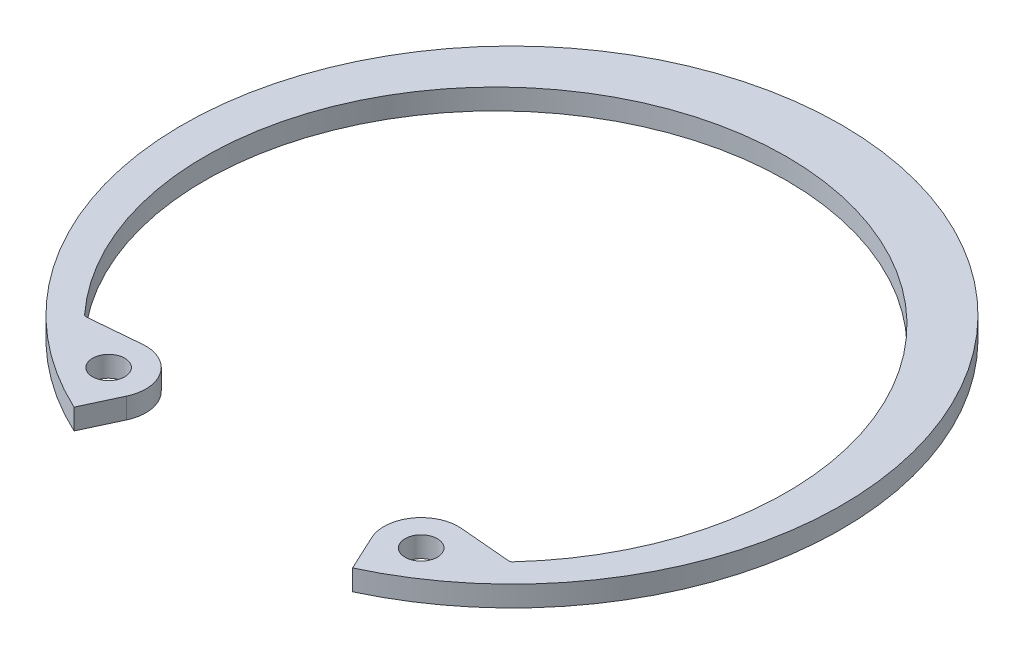
ISO-10303-21;
HEADER;
FILE_DESCRIPTION(('STEP AP214'),'2;1');
FILE_NAME('part.step','',(''),(''),'','','');
FILE_SCHEMA(('AUTOMOTIVE_DESIGN { 1 0 10303 214 1 1 1 1 }'));
ENDSEC;
DATA;
#1=APPLICATION_CONTEXT('core data for automotive mechanical design processes');
#2=APPLICATION_PROTOCOL_DEFINITION('international standard','automotive_design',2000,#1);
#3=PRODUCT_CONTEXT('',#1,'mechanical');
#4=PRODUCT('Part','Part','',(#3));
#5=PRODUCT_RELATED_PRODUCT_CATEGORY('part','',(#4));
#6=PRODUCT_DEFINITION_FORMATION('','',#4);
#7=PRODUCT_DEFINITION_CONTEXT('part definition',#1,'design');
#8=PRODUCT_DEFINITION('design','',#6,#7);
#9=PRODUCT_DEFINITION_SHAPE('','',#8);
#10=(LENGTH_UNIT() NAMED_UNIT(*) SI_UNIT(.MILLI.,.METRE.));
#11=(NAMED_UNIT(*) PLANE_ANGLE_UNIT() SI_UNIT($,.RADIAN.));
#12=(NAMED_UNIT(*) SI_UNIT($,.STERADIAN.) SOLID_ANGLE_UNIT());
#13=UNCERTAINTY_MEASURE_WITH_UNIT(LENGTH_MEASURE(1.E-05),#10,'distance_accuracy_value','');
#14=(GEOMETRIC_REPRESENTATION_CONTEXT(3) GLOBAL_UNCERTAINTY_ASSIGNED_CONTEXT((#13)) GLOBAL_UNIT_ASSIGNED_CONTEXT((#10,
#11,#12)) REPRESENTATION_CONTEXT('',''));
#15=CARTESIAN_POINT('',(0.,0.,0.));
#16=DIRECTION('',(0.,0.,1.));
#17=DIRECTION('',(1.,0.,0.));
#18=AXIS2_PLACEMENT_3D('',#15,#16,#17);
#19=CARTESIAN_POINT('',(9.59937081174738,-1.27,15.1767803192434));
#20=DIRECTION('',(0.,1.,0.));
#21=DIRECTION('',(0.,0.,1.));
#22=AXIS2_PLACEMENT_3D('',#19,#20,#21);
#23=CYLINDRICAL_SURFACE('',#22,2.286);
#24=CARTESIAN_POINT('',(9.59937081174738,0.,15.1767803192434));
#25=DIRECTION('',(0.,1.,0.));
#26=DIRECTION('',(0.,0.,-1.));
#27=AXIS2_PLACEMENT_3D('',#24,#25,#26);
#28=CIRCLE('',#27,2.286);
#29=CARTESIAN_POINT('',(9.79860883966853,0.,12.8994792394056));
#30=VERTEX_POINT('',#29);
#31=CARTESIAN_POINT('',(7.52755121058159,0.,16.1428856655826));
#32=VERTEX_POINT('',#31);
#33=EDGE_CURVE('E156',#30,#32,#28,.T.);
#34=ORIENTED_EDGE('',*,*,#33,.F.);
#35=DIRECTION('',(0.,1.,0.));
#36=VECTOR('',#35,1.);
#37=CARTESIAN_POINT('',(9.79860883966853,-1.27,12.8994792394056));
#38=LINE('',#37,#36);
#39=CARTESIAN_POINT('',(9.79860883966853,-1.27,12.8994792394056));
#40=VERTEX_POINT('',#39);
#41=EDGE_CURVE('E133',#40,#30,#38,.T.);
#42=ORIENTED_EDGE('',*,*,#41,.F.);
#43=CARTESIAN_POINT('',(9.59937081174738,-1.27,15.1767803192434));
#44=DIRECTION('',(0.,1.,0.));
#45=DIRECTION('',(0.,0.,-1.));
#46=AXIS2_PLACEMENT_3D('',#43,#44,#45);
#47=CIRCLE('',#46,2.286);
#48=CARTESIAN_POINT('',(7.52755121058159,-1.27,16.1428856655826));
#49=VERTEX_POINT('',#48);
#50=EDGE_CURVE('E126',#40,#49,#47,.T.);
#51=ORIENTED_EDGE('',*,*,#50,.T.);
#52=DIRECTION('',(0.,1.,0.));
#53=VECTOR('',#52,1.);
#54=CARTESIAN_POINT('',(7.52755121058159,-1.27,16.1428856655826));
#55=LINE('',#54,#53);
#56=EDGE_CURVE('E109',#49,#32,#55,.T.);
#57=ORIENTED_EDGE('',*,*,#56,.T.);
#58=EDGE_LOOP('',(#34,#42,#51,#57));
#59=FACE_BOUND('',#58,.T.);
#60=ADVANCED_FACE('F34',(#59),#23,.T.);
#61=CARTESIAN_POINT('',(13.0721459718184,-1.27,13.1858766280999));
#62=DIRECTION('',(0.0871557427476614,0.,-0.996194698091745));
#63=DIRECTION('',(-0.996194698091745,0.,-0.0871557427476614));
#64=AXIS2_PLACEMENT_3D('',#61,#62,#63);
#65=PLANE('',#64);
#66=DIRECTION('',(-0.996194698091745,0.,-0.0871557427476614));
#67=VECTOR('',#66,1.);
#68=CARTESIAN_POINT('',(13.0721459718184,0.,13.1858766280999));
#69=LINE('',#68,#67);
#70=CARTESIAN_POINT('',(12.9481380293736,0.,13.1750273389488));
#71=VERTEX_POINT('',#70);
#72=EDGE_CURVE('E134',#71,#30,#69,.T.);
#73=ORIENTED_EDGE('',*,*,#72,.F.);
#74=DIRECTION('',(0.,-1.,0.));
#75=VECTOR('',#74,1.);
#76=CARTESIAN_POINT('',(12.9481380293736,-1.27,13.1750273389488));
#77=LINE('',#76,#75);
#78=CARTESIAN_POINT('',(12.9481380293736,-1.27,13.1750273389488));
#79=VERTEX_POINT('',#78);
#80=EDGE_CURVE('E49',#71,#79,#77,.T.);
#81=ORIENTED_EDGE('',*,*,#80,.T.);
#82=DIRECTION('',(-0.996194698091745,0.,-0.0871557427476614));
#83=VECTOR('',#82,1.);
#84=CARTESIAN_POINT('',(13.0721459718184,-1.27,13.1858766280999));
#85=LINE('',#84,#83);
#86=EDGE_CURVE('E120',#79,#40,#85,.T.);
#87=ORIENTED_EDGE('',*,*,#86,.T.);
#88=ORIENTED_EDGE('',*,*,#41,.T.);
#89=EDGE_LOOP('',(#73,#81,#87,#88));
#90=FACE_BOUND('',#89,.T.);
#91=ADVANCED_FACE('F211',(#90),#65,.T.);
#92=CARTESIAN_POINT('',(0.,-1.27,1.00327648032471));
#93=DIRECTION('',(0.,1.,0.));
#94=DIRECTION('',(0.,0.,1.));
#95=AXIS2_PLACEMENT_3D('',#92,#93,#94);
#96=CYLINDRICAL_SURFACE('',#95,17.8688764803247);
#97=CARTESIAN_POINT('',(0.,0.,1.00327648032471));
#98=DIRECTION('',(0.,-1.,0.));
#99=DIRECTION('',(0.,0.,1.));
#100=AXIS2_PLACEMENT_3D('',#97,#98,#99);
#101=CIRCLE('',#100,17.8688764803247);
#102=CARTESIAN_POINT('',(-13.1573021620208,0.,13.0938573797846));
#103=VERTEX_POINT('',#102);
#104=CARTESIAN_POINT('',(13.1573021620208,0.,13.0938573797846));
#105=VERTEX_POINT('',#104);
#106=EDGE_CURVE('E136',#103,#105,#101,.T.);
#107=ORIENTED_EDGE('',*,*,#106,.F.);
#108=DIRECTION('',(0.,1.,0.));
#109=VECTOR('',#108,1.);
#110=CARTESIAN_POINT('',(-13.1573021620208,-1.27,13.0938573797846));
#111=LINE('',#110,#109);
#112=CARTESIAN_POINT('',(-13.1573021620208,-1.27,13.0938573797846));
#113=VERTEX_POINT('',#112);
#114=EDGE_CURVE('E187',#103,#113,#111,.F.);
#115=ORIENTED_EDGE('',*,*,#114,.T.);
#116=CARTESIAN_POINT('',(0.,-1.27,1.00327648032471));
#117=DIRECTION('',(0.,-1.,0.));
#118=DIRECTION('',(0.,0.,1.));
#119=AXIS2_PLACEMENT_3D('',#116,#117,#118);
#120=CIRCLE('',#119,17.8688764803247);
#121=CARTESIAN_POINT('',(13.1573021620208,-1.27,13.0938573797846));
#122=VERTEX_POINT('',#121);
#123=EDGE_CURVE('E152',#113,#122,#120,.T.);
#124=ORIENTED_EDGE('',*,*,#123,.T.);
#125=DIRECTION('',(0.,1.,0.));
#126=VECTOR('',#125,1.);
#127=CARTESIAN_POINT('',(13.1573021620208,-1.27,13.0938573797846));
#128=LINE('',#127,#126);
#129=EDGE_CURVE('E184',#122,#105,#128,.T.);
#130=ORIENTED_EDGE('',*,*,#129,.T.);
#131=EDGE_LOOP('',(#107,#115,#124,#130));
#132=FACE_BOUND('',#131,.T.);
#133=ADVANCED_FACE('F207',(#132),#96,.F.);
#134=CARTESIAN_POINT('',(-13.0721459718184,-1.27,13.1858766280999));
#135=DIRECTION('',(-0.0871557427476561,0.,-0.996194698091746));
#136=DIRECTION('',(-0.996194698091746,0.,0.0871557427476561));
#137=AXIS2_PLACEMENT_3D('',#134,#135,#136);
#138=PLANE('',#137);
#139=DIRECTION('',(-0.996194698091746,0.,0.0871557427476561));
#140=VECTOR('',#139,1.);
#141=CARTESIAN_POINT('',(-13.0721459718184,-1.27,13.1858766280999));
#142=LINE('',#141,#140);
#143=CARTESIAN_POINT('',(-9.79860883966852,-1.27,12.8994792394056));
#144=VERTEX_POINT('',#143);
#145=CARTESIAN_POINT('',(-12.9481380293736,-1.27,13.1750273389488));
#146=VERTEX_POINT('',#145);
#147=EDGE_CURVE('E149',#144,#146,#142,.T.);
#148=ORIENTED_EDGE('',*,*,#147,.T.);
#149=DIRECTION('',(0.,-1.,0.));
#150=VECTOR('',#149,1.);
#151=CARTESIAN_POINT('',(-12.9481380293736,0.,13.1750273389488));
#152=LINE('',#151,#150);
#153=CARTESIAN_POINT('',(-12.9481380293736,0.,13.1750273389488));
#154=VERTEX_POINT('',#153);
#155=EDGE_CURVE('E174',#146,#154,#152,.F.);
#156=ORIENTED_EDGE('',*,*,#155,.T.);
#157=DIRECTION('',(-0.996194698091746,0.,0.0871557427476561));
#158=VECTOR('',#157,1.);
#159=CARTESIAN_POINT('',(-13.0721459718184,0.,13.1858766280999));
#160=LINE('',#159,#158);
#161=CARTESIAN_POINT('',(-9.79860883966852,0.,12.8994792394056));
#162=VERTEX_POINT('',#161);
#163=EDGE_CURVE('E169',#162,#154,#160,.T.);
#164=ORIENTED_EDGE('',*,*,#163,.F.);
#165=DIRECTION('',(0.,1.,0.));
#166=VECTOR('',#165,1.);
#167=CARTESIAN_POINT('',(-9.79860883966852,-1.27,12.8994792394056));
#168=LINE('',#167,#166);
#169=EDGE_CURVE('E175',#144,#162,#168,.T.);
#170=ORIENTED_EDGE('',*,*,#169,.F.);
#171=EDGE_LOOP('',(#148,#156,#164,#170));
#172=FACE_BOUND('',#171,.T.);
#173=ADVANCED_FACE('F201',(#172),#138,.T.);
#174=CARTESIAN_POINT('',(-9.59937081174738,-1.27,15.1767803192434));
#175=DIRECTION('',(0.,1.,0.));
#176=DIRECTION('',(0.,0.,1.));
#177=AXIS2_PLACEMENT_3D('',#174,#175,#176);
#178=CYLINDRICAL_SURFACE('',#177,2.286);
#179=CARTESIAN_POINT('',(-9.59937081174738,0.,15.1767803192434));
#180=DIRECTION('',(0.,1.,0.));
#181=DIRECTION('',(0.,0.,1.));
#182=AXIS2_PLACEMENT_3D('',#179,#180,#181);
#183=CIRCLE('',#182,2.286);
#184=CARTESIAN_POINT('',(-7.52755121058159,0.,16.1428856655826));
#185=VERTEX_POINT('',#184);
#186=EDGE_CURVE('E166',#185,#162,#183,.T.);
#187=ORIENTED_EDGE('',*,*,#186,.F.);
#188=DIRECTION('',(0.,1.,0.));
#189=VECTOR('',#188,1.);
#190=CARTESIAN_POINT('',(-7.52755121058159,-1.27,16.1428856655826));
#191=LINE('',#190,#189);
#192=CARTESIAN_POINT('',(-7.52755121058159,-1.27,16.1428856655826));
#193=VERTEX_POINT('',#192);
#194=EDGE_CURVE('E177',#193,#185,#191,.T.);
#195=ORIENTED_EDGE('',*,*,#194,.F.);
#196=CARTESIAN_POINT('',(-9.59937081174738,-1.27,15.1767803192434));
#197=DIRECTION('',(0.,1.,0.));
#198=DIRECTION('',(0.,0.,1.));
#199=AXIS2_PLACEMENT_3D('',#196,#197,#198);
#200=CIRCLE('',#199,2.286);
#201=EDGE_CURVE('E146',#193,#144,#200,.T.);
#202=ORIENTED_EDGE('',*,*,#201,.T.);
#203=ORIENTED_EDGE('',*,*,#169,.T.);
#204=EDGE_LOOP('',(#187,#195,#202,#203));
#205=FACE_BOUND('',#204,.T.);
#206=ADVANCED_FACE('F220',(#205),#178,.T.);
#207=CARTESIAN_POINT('',(-8.55539956702626,-1.27,18.3471135792126));
#208=DIRECTION('',(0.906307787036653,0.,0.422618261740694));
#209=DIRECTION('',(0.422618261740694,0.,-0.906307787036653));
#210=AXIS2_PLACEMENT_3D('',#207,#208,#209);
#211=PLANE('',#210);
#212=DIRECTION('',(0.422618261740694,0.,-0.906307787036653));
#213=VECTOR('',#212,1.);
#214=CARTESIAN_POINT('',(-8.55539956702626,0.,18.3471135792126));
#215=LINE('',#214,#213);
#216=CARTESIAN_POINT('',(-8.55539956702627,0.,18.3471135792126));
#217=VERTEX_POINT('',#216);
#218=EDGE_CURVE('E163',#217,#185,#215,.T.);
#219=ORIENTED_EDGE('',*,*,#218,.F.);
#220=DIRECTION('',(0.,1.,0.));
#221=VECTOR('',#220,1.);
#222=CARTESIAN_POINT('',(-8.55539956702627,-1.27,18.3471135792126));
#223=LINE('',#222,#221);
#224=CARTESIAN_POINT('',(-8.55539956702627,-1.27,18.3471135792126));
#225=VERTEX_POINT('',#224);
#226=EDGE_CURVE('E179',#225,#217,#223,.T.);
#227=ORIENTED_EDGE('',*,*,#226,.F.);
#228=DIRECTION('',(0.422618261740694,0.,-0.906307787036653));
#229=VECTOR('',#228,1.);
#230=CARTESIAN_POINT('',(-8.55539956702626,-1.27,18.3471135792126));
#231=LINE('',#230,#229);
#232=EDGE_CURVE('E143',#225,#193,#231,.T.);
#233=ORIENTED_EDGE('',*,*,#232,.T.);
#234=ORIENTED_EDGE('',*,*,#194,.T.);
#235=EDGE_LOOP('',(#219,#227,#233,#234));
#236=FACE_BOUND('',#235,.T.);
#237=ADVANCED_FACE('F217',(#236),#211,.T.);
#238=CARTESIAN_POINT('',(0.,-1.27,0.));
#239=DIRECTION('',(0.,1.,0.));
#240=DIRECTION('',(0.,0.,1.));
#241=AXIS2_PLACEMENT_3D('',#238,#239,#240);
#242=CYLINDRICAL_SURFACE('',#241,20.2438);
#243=CARTESIAN_POINT('',(0.,0.,0.));
#244=DIRECTION('',(0.,1.,0.));
#245=DIRECTION('',(0.,0.,1.));
#246=AXIS2_PLACEMENT_3D('',#243,#244,#245);
#247=CIRCLE('',#246,20.2438);
#248=CARTESIAN_POINT('',(8.55539956702626,0.,18.3471135792126));
#249=VERTEX_POINT('',#248);
#250=EDGE_CURVE('E160',#249,#217,#247,.T.);
#251=ORIENTED_EDGE('',*,*,#250,.F.);
#252=DIRECTION('',(0.,1.,0.));
#253=VECTOR('',#252,1.);
#254=CARTESIAN_POINT('',(8.55539956702626,-1.27,18.3471135792126));
#255=LINE('',#254,#253);
#256=CARTESIAN_POINT('',(8.55539956702626,-1.27,18.3471135792126));
#257=VERTEX_POINT('',#256);
#258=EDGE_CURVE('E119',#257,#249,#255,.T.);
#259=ORIENTED_EDGE('',*,*,#258,.F.);
#260=CARTESIAN_POINT('',(0.,-1.27,0.));
#261=DIRECTION('',(0.,1.,0.));
#262=DIRECTION('',(0.,0.,1.));
#263=AXIS2_PLACEMENT_3D('',#260,#261,#262);
#264=CIRCLE('',#263,20.2438);
#265=EDGE_CURVE('E129',#257,#225,#264,.T.);
#266=ORIENTED_EDGE('',*,*,#265,.T.);
#267=ORIENTED_EDGE('',*,*,#226,.T.);
#268=EDGE_LOOP('',(#251,#259,#266,#267));
#269=FACE_BOUND('',#268,.T.);
#270=ADVANCED_FACE('F215',(#269),#242,.T.);
#271=CARTESIAN_POINT('',(8.55539956702626,-1.27,18.3471135792126));
#272=DIRECTION('',(-0.906307787036653,0.,0.422618261740694));
#273=DIRECTION('',(0.422618261740694,0.,0.906307787036653));
#274=AXIS2_PLACEMENT_3D('',#271,#272,#273);
#275=PLANE('',#274);
#276=DIRECTION('',(0.422618261740694,0.,0.906307787036653));
#277=VECTOR('',#276,1.);
#278=CARTESIAN_POINT('',(8.55539956702626,0.,18.3471135792126));
#279=LINE('',#278,#277);
#280=EDGE_CURVE('E114',#32,#249,#279,.T.);
#281=ORIENTED_EDGE('',*,*,#280,.F.);
#282=ORIENTED_EDGE('',*,*,#56,.F.);
#283=DIRECTION('',(0.422618261740694,0.,0.906307787036653));
#284=VECTOR('',#283,1.);
#285=CARTESIAN_POINT('',(8.55539956702626,-1.27,18.3471135792126));
#286=LINE('',#285,#284);
#287=EDGE_CURVE('E112',#49,#257,#286,.T.);
#288=ORIENTED_EDGE('',*,*,#287,.T.);
#289=ORIENTED_EDGE('',*,*,#258,.T.);
#290=EDGE_LOOP('',(#281,#282,#288,#289));
#291=FACE_BOUND('',#290,.T.);
#292=ADVANCED_FACE('F111',(#291),#275,.T.);
#293=CARTESIAN_POINT('',(9.59937081174738,-1.27,15.1767803192434));
#294=DIRECTION('',(0.,-1.,0.));
#295=DIRECTION('',(0.,0.,-1.));
#296=AXIS2_PLACEMENT_3D('',#293,#294,#295);
#297=PLANE('',#296);
#298=CARTESIAN_POINT('',(-9.59937081174738,-1.27,15.1767803192434));
#299=DIRECTION('',(0.,1.,0.));
#300=DIRECTION('',(0.,0.,1.));
#301=AXIS2_PLACEMENT_3D('',#298,#299,#300);
#302=CIRCLE('',#301,0.990599999999999);
#303=CARTESIAN_POINT('',(-9.59937081174738,-1.27,16.1673803192434));
#304=VERTEX_POINT('',#303);
#305=EDGE_CURVE('E361',#304,#304,#302,.T.);
#306=ORIENTED_EDGE('',*,*,#305,.T.);
#307=EDGE_LOOP('',(#306));
#308=FACE_BOUND('',#307,.T.);
#309=CARTESIAN_POINT('',(9.59937081174738,-1.27,15.1767803192434));
#310=DIRECTION('',(0.,1.,0.));
#311=DIRECTION('',(0.,0.,1.));
#312=AXIS2_PLACEMENT_3D('',#309,#310,#311);
#313=CIRCLE('',#312,0.990599999999999);
#314=CARTESIAN_POINT('',(9.59937081174738,-1.27,16.1673803192434));
#315=VERTEX_POINT('',#314);
#316=EDGE_CURVE('E158',#315,#315,#313,.T.);
#317=ORIENTED_EDGE('',*,*,#316,.T.);
#318=EDGE_LOOP('',(#317));
#319=FACE_BOUND('',#318,.T.);
#320=ORIENTED_EDGE('',*,*,#50,.F.);
#321=ORIENTED_EDGE('',*,*,#86,.F.);
#322=CARTESIAN_POINT('',(12.9702755880315,-1.27,12.9219938856335));
#323=DIRECTION('',(0.,-1.,0.));
#324=DIRECTION('',(0.,0.,-1.));
#325=AXIS2_PLACEMENT_3D('',#322,#323,#324);
#326=CIRCLE('',#325,0.254);
#327=EDGE_CURVE('E11',#79,#122,#326,.F.);
#328=ORIENTED_EDGE('',*,*,#327,.T.);
#329=ORIENTED_EDGE('',*,*,#123,.F.);
#330=CARTESIAN_POINT('',(-12.9702755880315,-1.27,12.9219938856335));
#331=DIRECTION('',(0.,-1.,0.));
#332=DIRECTION('',(0.,0.,-1.));
#333=AXIS2_PLACEMENT_3D('',#330,#331,#332);
#334=CIRCLE('',#333,0.254);
#335=EDGE_CURVE('E192',#113,#146,#334,.F.);
#336=ORIENTED_EDGE('',*,*,#335,.T.);
#337=ORIENTED_EDGE('',*,*,#147,.F.);
#338=ORIENTED_EDGE('',*,*,#201,.F.);
#339=ORIENTED_EDGE('',*,*,#232,.F.);
#340=ORIENTED_EDGE('',*,*,#265,.F.);
#341=ORIENTED_EDGE('',*,*,#287,.F.);
#342=EDGE_LOOP('',(#320,#321,#328,#329,#336,#337,#338,#339,#340,#341));
#343=FACE_BOUND('',#342,.T.);
#344=ADVANCED_FACE('F125',(#308,#319,#343),#297,.T.);
#345=CARTESIAN_POINT('',(9.59937081174738,0.,15.1767803192434));
#346=DIRECTION('',(0.,-1.,0.));
#347=DIRECTION('',(0.,0.,-1.));
#348=AXIS2_PLACEMENT_3D('',#345,#346,#347);
#349=PLANE('',#348);
#350=CARTESIAN_POINT('',(-9.59937081174738,0.,15.1767803192434));
#351=DIRECTION('',(0.,1.,0.));
#352=DIRECTION('',(0.,0.,1.));
#353=AXIS2_PLACEMENT_3D('',#350,#351,#352);
#354=CIRCLE('',#353,0.990599999999999);
#355=CARTESIAN_POINT('',(-9.59937081174738,0.,16.1673803192434));
#356=VERTEX_POINT('',#355);
#357=EDGE_CURVE('E357',#356,#356,#354,.T.);
#358=ORIENTED_EDGE('',*,*,#357,.F.);
#359=EDGE_LOOP('',(#358));
#360=FACE_BOUND('',#359,.T.);
#361=CARTESIAN_POINT('',(9.59937081174738,0.,15.1767803192434));
#362=DIRECTION('',(0.,1.,0.));
#363=DIRECTION('',(0.,0.,1.));
#364=AXIS2_PLACEMENT_3D('',#361,#362,#363);
#365=CIRCLE('',#364,0.990599999999999);
#366=CARTESIAN_POINT('',(9.59937081174738,0.,16.1673803192434));
#367=VERTEX_POINT('',#366);
#368=EDGE_CURVE('E139',#367,#367,#365,.T.);
#369=ORIENTED_EDGE('',*,*,#368,.F.);
#370=EDGE_LOOP('',(#369));
#371=FACE_BOUND('',#370,.T.);
#372=ORIENTED_EDGE('',*,*,#33,.T.);
#373=ORIENTED_EDGE('',*,*,#280,.T.);
#374=ORIENTED_EDGE('',*,*,#250,.T.);
#375=ORIENTED_EDGE('',*,*,#218,.T.);
#376=ORIENTED_EDGE('',*,*,#186,.T.);
#377=ORIENTED_EDGE('',*,*,#163,.T.);
#378=CARTESIAN_POINT('',(-12.9702755880315,0.,12.9219938856335));
#379=DIRECTION('',(0.,-1.,0.));
#380=DIRECTION('',(0.,0.,-1.));
#381=AXIS2_PLACEMENT_3D('',#378,#379,#380);
#382=CIRCLE('',#381,0.254);
#383=EDGE_CURVE('E190',#154,#103,#382,.T.);
#384=ORIENTED_EDGE('',*,*,#383,.T.);
#385=ORIENTED_EDGE('',*,*,#106,.T.);
#386=CARTESIAN_POINT('',(12.9702755880315,0.,12.9219938856335));
#387=DIRECTION('',(0.,-1.,0.));
#388=DIRECTION('',(0.,0.,-1.));
#389=AXIS2_PLACEMENT_3D('',#386,#387,#388);
#390=CIRCLE('',#389,0.254);
#391=EDGE_CURVE('E42',#105,#71,#390,.T.);
#392=ORIENTED_EDGE('',*,*,#391,.T.);
#393=ORIENTED_EDGE('',*,*,#72,.T.);
#394=EDGE_LOOP('',(#372,#373,#374,#375,#376,#377,#384,#385,#392,#393));
#395=FACE_BOUND('',#394,.T.);
#396=ADVANCED_FACE('F205',(#360,#371,#395),#349,.F.);
#397=CARTESIAN_POINT('',(9.59937081174738,-1.27,15.1767803192434));
#398=DIRECTION('',(0.,1.,0.));
#399=DIRECTION('',(0.,0.,1.));
#400=AXIS2_PLACEMENT_3D('',#397,#398,#399);
#401=CYLINDRICAL_SURFACE('',#400,0.990599999999999);
#402=ORIENTED_EDGE('',*,*,#316,.F.);
#403=EDGE_LOOP('',(#402));
#404=FACE_BOUND('',#403,.T.);
#405=ORIENTED_EDGE('',*,*,#368,.T.);
#406=EDGE_LOOP('',(#405));
#407=FACE_BOUND('',#406,.T.);
#408=ADVANCED_FACE('F243',(#404,#407),#401,.F.);
#409=CARTESIAN_POINT('',(-9.59937081174738,-1.27,15.1767803192434));
#410=DIRECTION('',(0.,1.,0.));
#411=DIRECTION('',(0.,0.,1.));
#412=AXIS2_PLACEMENT_3D('',#409,#410,#411);
#413=CYLINDRICAL_SURFACE('',#412,0.990599999999999);
#414=ORIENTED_EDGE('',*,*,#305,.F.);
#415=EDGE_LOOP('',(#414));
#416=FACE_BOUND('',#415,.T.);
#417=ORIENTED_EDGE('',*,*,#357,.T.);
#418=EDGE_LOOP('',(#417));
#419=FACE_BOUND('',#418,.T.);
#420=ADVANCED_FACE('F238',(#416,#419),#413,.F.);
#421=CARTESIAN_POINT('',(-12.9702755880315,-1.27,12.9219938856335));
#422=DIRECTION('',(0.,1.,0.));
#423=DIRECTION('',(0.,0.,1.));
#424=AXIS2_PLACEMENT_3D('',#421,#422,#423);
#425=CYLINDRICAL_SURFACE('',#424,0.254);
#426=ORIENTED_EDGE('',*,*,#335,.F.);
#427=ORIENTED_EDGE('',*,*,#114,.F.);
#428=ORIENTED_EDGE('',*,*,#383,.F.);
#429=ORIENTED_EDGE('',*,*,#155,.F.);
#430=EDGE_LOOP('',(#426,#427,#428,#429));
#431=FACE_BOUND('',#430,.T.);
#432=ADVANCED_FACE('F203',(#431),#425,.F.);
#433=CARTESIAN_POINT('',(12.9702755880315,-1.27,12.9219938856335));
#434=DIRECTION('',(0.,1.,0.));
#435=DIRECTION('',(0.,0.,1.));
#436=AXIS2_PLACEMENT_3D('',#433,#434,#435);
#437=CYLINDRICAL_SURFACE('',#436,0.254);
#438=ORIENTED_EDGE('',*,*,#327,.F.);
#439=ORIENTED_EDGE('',*,*,#80,.F.);
#440=ORIENTED_EDGE('',*,*,#391,.F.);
#441=ORIENTED_EDGE('',*,*,#129,.F.);
#442=EDGE_LOOP('',(#438,#439,#440,#441));
#443=FACE_BOUND('',#442,.T.);
#444=ADVANCED_FACE('F36',(#443),#437,.F.);
#445=CLOSED_SHELL('',(#60,#91,#133,#173,#206,#237,#270,#292,#344,#396,#408,#420,#432,#444));
#446=MANIFOLD_SOLID_BREP('B2',#445);
#447=ADVANCED_BREP_SHAPE_REPRESENTATION('',(#18,#446),#14);
#448=SHAPE_DEFINITION_REPRESENTATION(#9,#447);
ENDSEC;
END-ISO-10303-21;
